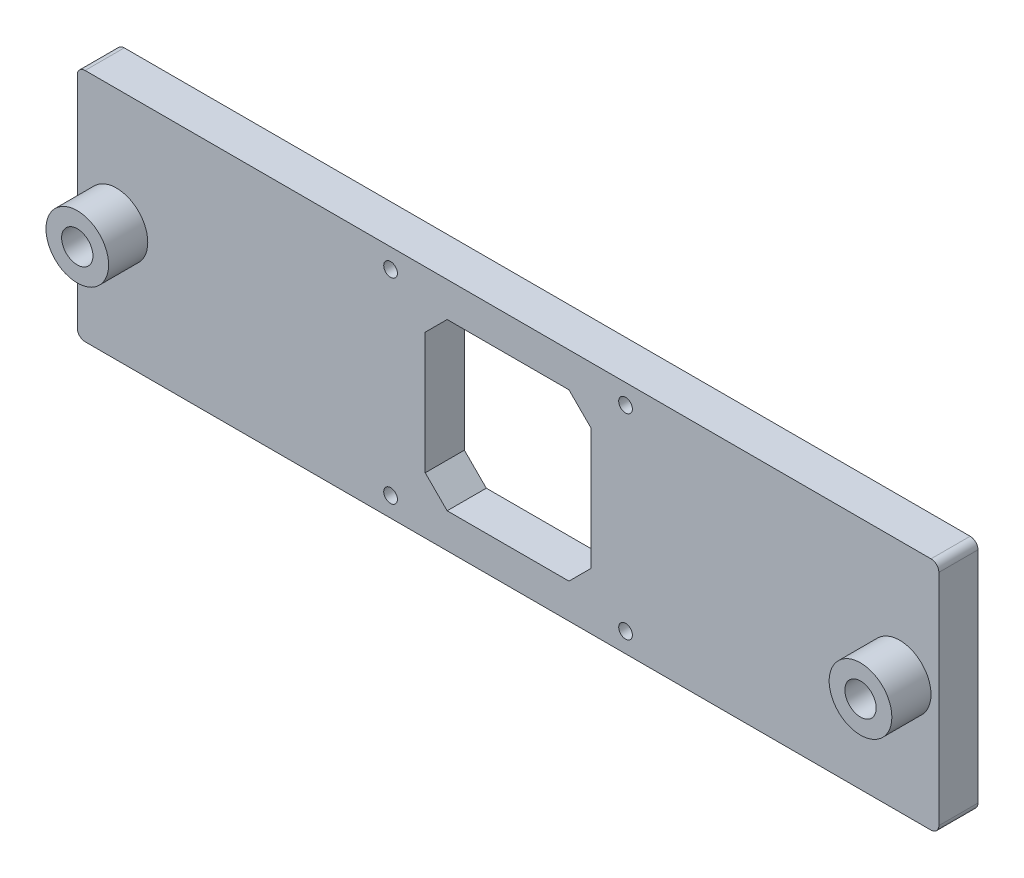
ISO-10303-21;
HEADER;
FILE_DESCRIPTION(('STEP AP214'),'2;1');
FILE_NAME('part.step','',(''),(''),'','','');
FILE_SCHEMA(('AUTOMOTIVE_DESIGN { 1 0 10303 214 1 1 1 1 }'));
ENDSEC;
DATA;
#1=APPLICATION_CONTEXT('core data for automotive mechanical design processes');
#2=APPLICATION_PROTOCOL_DEFINITION('international standard','automotive_design',2000,#1);
#3=PRODUCT_CONTEXT('',#1,'mechanical');
#4=PRODUCT('Part','Part','',(#3));
#5=PRODUCT_RELATED_PRODUCT_CATEGORY('part','',(#4));
#6=PRODUCT_DEFINITION_FORMATION('','',#4);
#7=PRODUCT_DEFINITION_CONTEXT('part definition',#1,'design');
#8=PRODUCT_DEFINITION('design','',#6,#7);
#9=PRODUCT_DEFINITION_SHAPE('','',#8);
#10=(LENGTH_UNIT() NAMED_UNIT(*) SI_UNIT(.MILLI.,.METRE.));
#11=(NAMED_UNIT(*) PLANE_ANGLE_UNIT() SI_UNIT($,.RADIAN.));
#12=(NAMED_UNIT(*) SI_UNIT($,.STERADIAN.) SOLID_ANGLE_UNIT());
#13=UNCERTAINTY_MEASURE_WITH_UNIT(LENGTH_MEASURE(1.E-05),#10,'distance_accuracy_value','');
#14=(GEOMETRIC_REPRESENTATION_CONTEXT(3) GLOBAL_UNCERTAINTY_ASSIGNED_CONTEXT((#13)) GLOBAL_UNIT_ASSIGNED_CONTEXT((#10,
#11,#12)) REPRESENTATION_CONTEXT('',''));
#15=CARTESIAN_POINT('',(0.,0.,0.));
#16=DIRECTION('',(0.,0.,1.));
#17=DIRECTION('',(1.,0.,0.));
#18=AXIS2_PLACEMENT_3D('',#15,#16,#17);
#19=CARTESIAN_POINT('',(0.,0.,5.));
#20=DIRECTION('',(0.,0.,1.));
#21=DIRECTION('',(1.,0.,0.));
#22=AXIS2_PLACEMENT_3D('',#19,#20,#21);
#23=PLANE('',#22);
#24=CARTESIAN_POINT('',(-30.,-25.,5.));
#25=DIRECTION('',(0.,0.,1.));
#26=DIRECTION('',(1.,0.,0.));
#27=AXIS2_PLACEMENT_3D('',#24,#25,#26);
#28=CIRCLE('',#27,1.75);
#29=CARTESIAN_POINT('',(-28.25,-25.,5.));
#30=VERTEX_POINT('',#29);
#31=EDGE_CURVE('E383',#30,#30,#28,.T.);
#32=ORIENTED_EDGE('',*,*,#31,.F.);
#33=EDGE_LOOP('',(#32));
#34=FACE_BOUND('',#33,.T.);
#35=CARTESIAN_POINT('',(30.,25.,5.));
#36=DIRECTION('',(0.,0.,1.));
#37=DIRECTION('',(1.,0.,0.));
#38=AXIS2_PLACEMENT_3D('',#35,#36,#37);
#39=CIRCLE('',#38,1.75);
#40=CARTESIAN_POINT('',(31.75,25.,5.));
#41=VERTEX_POINT('',#40);
#42=EDGE_CURVE('E374',#41,#41,#39,.T.);
#43=ORIENTED_EDGE('',*,*,#42,.F.);
#44=EDGE_LOOP('',(#43));
#45=FACE_BOUND('',#44,.T.);
#46=CARTESIAN_POINT('',(30.,-25.,5.));
#47=DIRECTION('',(0.,0.,1.));
#48=DIRECTION('',(1.,0.,0.));
#49=AXIS2_PLACEMENT_3D('',#46,#47,#48);
#50=CIRCLE('',#49,1.75);
#51=CARTESIAN_POINT('',(31.75,-25.,5.));
#52=VERTEX_POINT('',#51);
#53=EDGE_CURVE('E390',#52,#52,#50,.T.);
#54=ORIENTED_EDGE('',*,*,#53,.F.);
#55=EDGE_LOOP('',(#54));
#56=FACE_BOUND('',#55,.T.);
#57=CARTESIAN_POINT('',(-30.,25.,5.));
#58=DIRECTION('',(0.,0.,1.));
#59=DIRECTION('',(1.,0.,0.));
#60=AXIS2_PLACEMENT_3D('',#57,#58,#59);
#61=CIRCLE('',#60,1.75);
#62=CARTESIAN_POINT('',(-28.25,25.,5.));
#63=VERTEX_POINT('',#62);
#64=EDGE_CURVE('E366',#63,#63,#61,.T.);
#65=ORIENTED_EDGE('',*,*,#64,.F.);
#66=EDGE_LOOP('',(#65));
#67=FACE_BOUND('',#66,.T.);
#68=CARTESIAN_POINT('',(-100.,0.,5.));
#69=DIRECTION('',(0.,0.,1.));
#70=DIRECTION('',(1.,0.,0.));
#71=AXIS2_PLACEMENT_3D('',#68,#69,#70);
#72=CIRCLE('',#71,8.);
#73=CARTESIAN_POINT('',(-92.,0.,5.));
#74=VERTEX_POINT('',#73);
#75=EDGE_CURVE('E342',#74,#74,#72,.T.);
#76=ORIENTED_EDGE('',*,*,#75,.F.);
#77=EDGE_LOOP('',(#76));
#78=FACE_BOUND('',#77,.T.);
#79=DIRECTION('',(-1.,0.,0.));
#80=VECTOR('',#79,1.);
#81=CARTESIAN_POINT('',(-110.,30.,5.));
#82=LINE('',#81,#80);
#83=CARTESIAN_POINT('',(108.,30.,5.));
#84=VERTEX_POINT('',#83);
#85=CARTESIAN_POINT('',(-108.,30.,5.));
#86=VERTEX_POINT('',#85);
#87=EDGE_CURVE('E292',#84,#86,#82,.T.);
#88=ORIENTED_EDGE('',*,*,#87,.T.);
#89=CARTESIAN_POINT('',(-108.,28.,5.));
#90=DIRECTION('',(0.,0.,1.));
#91=DIRECTION('',(1.,0.,0.));
#92=AXIS2_PLACEMENT_3D('',#89,#90,#91);
#93=CIRCLE('',#92,2.);
#94=CARTESIAN_POINT('',(-110.,28.,5.));
#95=VERTEX_POINT('',#94);
#96=EDGE_CURVE('E267',#86,#95,#93,.T.);
#97=ORIENTED_EDGE('',*,*,#96,.T.);
#98=DIRECTION('',(0.,-1.,0.));
#99=VECTOR('',#98,1.);
#100=CARTESIAN_POINT('',(-110.,30.,5.));
#101=LINE('',#100,#99);
#102=CARTESIAN_POINT('',(-110.,-28.,5.));
#103=VERTEX_POINT('',#102);
#104=EDGE_CURVE('E189',#95,#103,#101,.T.);
#105=ORIENTED_EDGE('',*,*,#104,.T.);
#106=CARTESIAN_POINT('',(-108.,-28.,5.));
#107=DIRECTION('',(0.,0.,1.));
#108=DIRECTION('',(1.,0.,0.));
#109=AXIS2_PLACEMENT_3D('',#106,#107,#108);
#110=CIRCLE('',#109,2.);
#111=CARTESIAN_POINT('',(-108.,-30.,5.));
#112=VERTEX_POINT('',#111);
#113=EDGE_CURVE('E60',#103,#112,#110,.T.);
#114=ORIENTED_EDGE('',*,*,#113,.T.);
#115=DIRECTION('',(1.,0.,0.));
#116=VECTOR('',#115,1.);
#117=CARTESIAN_POINT('',(-110.,-30.,5.));
#118=LINE('',#117,#116);
#119=CARTESIAN_POINT('',(108.,-30.,5.));
#120=VERTEX_POINT('',#119);
#121=EDGE_CURVE('E183',#112,#120,#118,.T.);
#122=ORIENTED_EDGE('',*,*,#121,.T.);
#123=CARTESIAN_POINT('',(108.,-28.,5.));
#124=DIRECTION('',(0.,0.,1.));
#125=DIRECTION('',(1.,0.,0.));
#126=AXIS2_PLACEMENT_3D('',#123,#124,#125);
#127=CIRCLE('',#126,2.);
#128=CARTESIAN_POINT('',(110.,-28.,5.));
#129=VERTEX_POINT('',#128);
#130=EDGE_CURVE('E261',#120,#129,#127,.T.);
#131=ORIENTED_EDGE('',*,*,#130,.T.);
#132=DIRECTION('',(0.,1.,0.));
#133=VECTOR('',#132,1.);
#134=CARTESIAN_POINT('',(110.,30.,5.));
#135=LINE('',#134,#133);
#136=CARTESIAN_POINT('',(110.,28.,5.));
#137=VERTEX_POINT('',#136);
#138=EDGE_CURVE('E287',#129,#137,#135,.T.);
#139=ORIENTED_EDGE('',*,*,#138,.T.);
#140=CARTESIAN_POINT('',(108.,28.,5.));
#141=DIRECTION('',(0.,0.,1.));
#142=DIRECTION('',(1.,0.,0.));
#143=AXIS2_PLACEMENT_3D('',#140,#141,#142);
#144=CIRCLE('',#143,2.);
#145=EDGE_CURVE('E264',#137,#84,#144,.T.);
#146=ORIENTED_EDGE('',*,*,#145,.T.);
#147=EDGE_LOOP('',(#88,#97,#105,#114,#122,#131,#139,#146));
#148=FACE_BOUND('',#147,.T.);
#149=DIRECTION('',(-1.,0.,0.));
#150=VECTOR('',#149,1.);
#151=CARTESIAN_POINT('',(-21.15,21.15,5.));
#152=LINE('',#151,#150);
#153=CARTESIAN_POINT('',(15.5498,21.15,5.));
#154=VERTEX_POINT('',#153);
#155=CARTESIAN_POINT('',(-15.5498,21.15,5.));
#156=VERTEX_POINT('',#155);
#157=EDGE_CURVE('E328',#154,#156,#152,.T.);
#158=ORIENTED_EDGE('',*,*,#157,.F.);
#159=DIRECTION('',(-0.707106781186548,0.707106781186547,0.));
#160=VECTOR('',#159,1.);
#161=CARTESIAN_POINT('',(21.15,15.5498,5.));
#162=LINE('',#161,#160);
#163=CARTESIAN_POINT('',(21.15,15.5498,5.));
#164=VERTEX_POINT('',#163);
#165=EDGE_CURVE('E166',#154,#164,#162,.F.);
#166=ORIENTED_EDGE('',*,*,#165,.T.);
#167=DIRECTION('',(0.,1.,0.));
#168=VECTOR('',#167,1.);
#169=CARTESIAN_POINT('',(21.15,21.15,5.));
#170=LINE('',#169,#168);
#171=CARTESIAN_POINT('',(21.15,-15.5498,5.));
#172=VERTEX_POINT('',#171);
#173=EDGE_CURVE('E314',#172,#164,#170,.T.);
#174=ORIENTED_EDGE('',*,*,#173,.F.);
#175=DIRECTION('',(0.707106781186548,0.707106781186548,0.));
#176=VECTOR('',#175,1.);
#177=CARTESIAN_POINT('',(15.5498,-21.15,5.));
#178=LINE('',#177,#176);
#179=CARTESIAN_POINT('',(15.5498,-21.15,5.));
#180=VERTEX_POINT('',#179);
#181=EDGE_CURVE('E224',#172,#180,#178,.F.);
#182=ORIENTED_EDGE('',*,*,#181,.T.);
#183=DIRECTION('',(1.,0.,0.));
#184=VECTOR('',#183,1.);
#185=CARTESIAN_POINT('',(-21.15,-21.15,5.));
#186=LINE('',#185,#184);
#187=CARTESIAN_POINT('',(-15.5498,-21.15,5.));
#188=VERTEX_POINT('',#187);
#189=EDGE_CURVE('E304',#188,#180,#186,.T.);
#190=ORIENTED_EDGE('',*,*,#189,.F.);
#191=DIRECTION('',(0.707106781186547,-0.707106781186548,0.));
#192=VECTOR('',#191,1.);
#193=CARTESIAN_POINT('',(-21.15,-15.5498,5.));
#194=LINE('',#193,#192);
#195=CARTESIAN_POINT('',(-21.15,-15.5498,5.));
#196=VERTEX_POINT('',#195);
#197=EDGE_CURVE('E230',#188,#196,#194,.F.);
#198=ORIENTED_EDGE('',*,*,#197,.T.);
#199=DIRECTION('',(0.,-1.,0.));
#200=VECTOR('',#199,1.);
#201=CARTESIAN_POINT('',(-21.15,21.15,5.));
#202=LINE('',#201,#200);
#203=CARTESIAN_POINT('',(-21.15,15.5498,5.));
#204=VERTEX_POINT('',#203);
#205=EDGE_CURVE('E324',#204,#196,#202,.T.);
#206=ORIENTED_EDGE('',*,*,#205,.F.);
#207=DIRECTION('',(-0.707106781186548,-0.707106781186547,0.));
#208=VECTOR('',#207,1.);
#209=CARTESIAN_POINT('',(-15.5498,21.15,5.));
#210=LINE('',#209,#208);
#211=EDGE_CURVE('E167',#204,#156,#210,.F.);
#212=ORIENTED_EDGE('',*,*,#211,.T.);
#213=EDGE_LOOP('',(#158,#166,#174,#182,#190,#198,#206,#212));
#214=FACE_BOUND('',#213,.T.);
#215=CARTESIAN_POINT('',(100.,0.,5.));
#216=DIRECTION('',(0.,0.,1.));
#217=DIRECTION('',(1.,0.,0.));
#218=AXIS2_PLACEMENT_3D('',#215,#216,#217);
#219=CIRCLE('',#218,8.00000000000001);
#220=CARTESIAN_POINT('',(108.,0.,5.));
#221=VERTEX_POINT('',#220);
#222=EDGE_CURVE('E354',#221,#221,#219,.T.);
#223=ORIENTED_EDGE('',*,*,#222,.F.);
#224=EDGE_LOOP('',(#223));
#225=FACE_BOUND('',#224,.T.);
#226=ADVANCED_FACE('F39',(#34,#45,#56,#67,#78,#148,#214,#225),#23,.T.);
#227=CARTESIAN_POINT('',(0.,0.,-5.));
#228=DIRECTION('',(0.,0.,1.));
#229=DIRECTION('',(1.,0.,0.));
#230=AXIS2_PLACEMENT_3D('',#227,#228,#229);
#231=PLANE('',#230);
#232=CARTESIAN_POINT('',(-30.,-25.,-5.));
#233=DIRECTION('',(0.,0.,1.));
#234=DIRECTION('',(1.,0.,0.));
#235=AXIS2_PLACEMENT_3D('',#232,#233,#234);
#236=CIRCLE('',#235,1.75);
#237=CARTESIAN_POINT('',(-28.25,-25.,-5.));
#238=VERTEX_POINT('',#237);
#239=EDGE_CURVE('E370',#238,#238,#236,.T.);
#240=ORIENTED_EDGE('',*,*,#239,.T.);
#241=EDGE_LOOP('',(#240));
#242=FACE_BOUND('',#241,.T.);
#243=CARTESIAN_POINT('',(30.,25.,-5.));
#244=DIRECTION('',(0.,0.,1.));
#245=DIRECTION('',(1.,0.,0.));
#246=AXIS2_PLACEMENT_3D('',#243,#244,#245);
#247=CIRCLE('',#246,1.75);
#248=CARTESIAN_POINT('',(31.75,25.,-5.));
#249=VERTEX_POINT('',#248);
#250=EDGE_CURVE('E378',#249,#249,#247,.T.);
#251=ORIENTED_EDGE('',*,*,#250,.T.);
#252=EDGE_LOOP('',(#251));
#253=FACE_BOUND('',#252,.T.);
#254=CARTESIAN_POINT('',(30.,-25.,-5.));
#255=DIRECTION('',(0.,0.,1.));
#256=DIRECTION('',(1.,0.,0.));
#257=AXIS2_PLACEMENT_3D('',#254,#255,#256);
#258=CIRCLE('',#257,1.75);
#259=CARTESIAN_POINT('',(31.75,-25.,-5.));
#260=VERTEX_POINT('',#259);
#261=EDGE_CURVE('E379',#260,#260,#258,.T.);
#262=ORIENTED_EDGE('',*,*,#261,.T.);
#263=EDGE_LOOP('',(#262));
#264=FACE_BOUND('',#263,.T.);
#265=CARTESIAN_POINT('',(-30.,25.,-5.));
#266=DIRECTION('',(0.,0.,1.));
#267=DIRECTION('',(1.,0.,0.));
#268=AXIS2_PLACEMENT_3D('',#265,#266,#267);
#269=CIRCLE('',#268,1.75);
#270=CARTESIAN_POINT('',(-28.25,25.,-5.));
#271=VERTEX_POINT('',#270);
#272=EDGE_CURVE('E365',#271,#271,#269,.T.);
#273=ORIENTED_EDGE('',*,*,#272,.T.);
#274=EDGE_LOOP('',(#273));
#275=FACE_BOUND('',#274,.T.);
#276=DIRECTION('',(0.,-1.,0.));
#277=VECTOR('',#276,1.);
#278=CARTESIAN_POINT('',(-110.,30.,-5.));
#279=LINE('',#278,#277);
#280=CARTESIAN_POINT('',(-110.,28.,-5.));
#281=VERTEX_POINT('',#280);
#282=CARTESIAN_POINT('',(-110.,-28.,-5.));
#283=VERTEX_POINT('',#282);
#284=EDGE_CURVE('E288',#281,#283,#279,.T.);
#285=ORIENTED_EDGE('',*,*,#284,.F.);
#286=CARTESIAN_POINT('',(-108.,28.,-5.));
#287=DIRECTION('',(0.,0.,1.));
#288=DIRECTION('',(1.,0.,0.));
#289=AXIS2_PLACEMENT_3D('',#286,#287,#288);
#290=CIRCLE('',#289,2.);
#291=CARTESIAN_POINT('',(-108.,30.,-5.));
#292=VERTEX_POINT('',#291);
#293=EDGE_CURVE('E249',#281,#292,#290,.F.);
#294=ORIENTED_EDGE('',*,*,#293,.T.);
#295=DIRECTION('',(-1.,0.,0.));
#296=VECTOR('',#295,1.);
#297=CARTESIAN_POINT('',(-110.,30.,-5.));
#298=LINE('',#297,#296);
#299=CARTESIAN_POINT('',(108.,30.,-5.));
#300=VERTEX_POINT('',#299);
#301=EDGE_CURVE('E294',#300,#292,#298,.T.);
#302=ORIENTED_EDGE('',*,*,#301,.F.);
#303=CARTESIAN_POINT('',(108.,28.,-5.));
#304=DIRECTION('',(0.,0.,1.));
#305=DIRECTION('',(1.,0.,0.));
#306=AXIS2_PLACEMENT_3D('',#303,#304,#305);
#307=CIRCLE('',#306,2.);
#308=CARTESIAN_POINT('',(110.,28.,-5.));
#309=VERTEX_POINT('',#308);
#310=EDGE_CURVE('E246',#300,#309,#307,.F.);
#311=ORIENTED_EDGE('',*,*,#310,.T.);
#312=DIRECTION('',(0.,1.,0.));
#313=VECTOR('',#312,1.);
#314=CARTESIAN_POINT('',(110.,30.,-5.));
#315=LINE('',#314,#313);
#316=CARTESIAN_POINT('',(110.,-28.,-5.));
#317=VERTEX_POINT('',#316);
#318=EDGE_CURVE('E299',#317,#309,#315,.T.);
#319=ORIENTED_EDGE('',*,*,#318,.F.);
#320=CARTESIAN_POINT('',(108.,-28.,-5.));
#321=DIRECTION('',(0.,0.,1.));
#322=DIRECTION('',(1.,0.,0.));
#323=AXIS2_PLACEMENT_3D('',#320,#321,#322);
#324=CIRCLE('',#323,2.);
#325=CARTESIAN_POINT('',(108.,-30.,-5.));
#326=VERTEX_POINT('',#325);
#327=EDGE_CURVE('E243',#317,#326,#324,.F.);
#328=ORIENTED_EDGE('',*,*,#327,.T.);
#329=DIRECTION('',(1.,0.,0.));
#330=VECTOR('',#329,1.);
#331=CARTESIAN_POINT('',(-110.,-30.,-5.));
#332=LINE('',#331,#330);
#333=CARTESIAN_POINT('',(-108.,-30.,-5.));
#334=VERTEX_POINT('',#333);
#335=EDGE_CURVE('E192',#334,#326,#332,.T.);
#336=ORIENTED_EDGE('',*,*,#335,.F.);
#337=CARTESIAN_POINT('',(-108.,-28.,-5.));
#338=DIRECTION('',(0.,0.,1.));
#339=DIRECTION('',(1.,0.,0.));
#340=AXIS2_PLACEMENT_3D('',#337,#338,#339);
#341=CIRCLE('',#340,2.);
#342=EDGE_CURVE('E240',#334,#283,#341,.F.);
#343=ORIENTED_EDGE('',*,*,#342,.T.);
#344=EDGE_LOOP('',(#285,#294,#302,#311,#319,#328,#336,#343));
#345=FACE_BOUND('',#344,.T.);
#346=DIRECTION('',(1.,0.,0.));
#347=VECTOR('',#346,1.);
#348=CARTESIAN_POINT('',(-21.15,-21.15,-5.));
#349=LINE('',#348,#347);
#350=CARTESIAN_POINT('',(-15.5498,-21.15,-5.));
#351=VERTEX_POINT('',#350);
#352=CARTESIAN_POINT('',(15.5498,-21.15,-5.));
#353=VERTEX_POINT('',#352);
#354=EDGE_CURVE('E311',#351,#353,#349,.T.);
#355=ORIENTED_EDGE('',*,*,#354,.T.);
#356=DIRECTION('',(-0.707106781186548,-0.707106781186548,0.));
#357=VECTOR('',#356,1.);
#358=CARTESIAN_POINT('',(18.3499,-18.3499,-5.));
#359=LINE('',#358,#357);
#360=CARTESIAN_POINT('',(21.15,-15.5498,-5.));
#361=VERTEX_POINT('',#360);
#362=EDGE_CURVE('E221',#353,#361,#359,.F.);
#363=ORIENTED_EDGE('',*,*,#362,.T.);
#364=DIRECTION('',(0.,1.,0.));
#365=VECTOR('',#364,1.);
#366=CARTESIAN_POINT('',(21.15,21.15,-5.));
#367=LINE('',#366,#365);
#368=CARTESIAN_POINT('',(21.15,15.5498,-5.));
#369=VERTEX_POINT('',#368);
#370=EDGE_CURVE('E160',#361,#369,#367,.T.);
#371=ORIENTED_EDGE('',*,*,#370,.T.);
#372=DIRECTION('',(0.707106781186548,-0.707106781186547,0.));
#373=VECTOR('',#372,1.);
#374=CARTESIAN_POINT('',(18.3499,18.3499,-5.));
#375=LINE('',#374,#373);
#376=CARTESIAN_POINT('',(15.5498,21.15,-5.));
#377=VERTEX_POINT('',#376);
#378=EDGE_CURVE('E153',#369,#377,#375,.F.);
#379=ORIENTED_EDGE('',*,*,#378,.T.);
#380=DIRECTION('',(-1.,0.,0.));
#381=VECTOR('',#380,1.);
#382=CARTESIAN_POINT('',(-21.15,21.15,-5.));
#383=LINE('',#382,#381);
#384=CARTESIAN_POINT('',(-15.5498,21.15,-5.));
#385=VERTEX_POINT('',#384);
#386=EDGE_CURVE('E158',#377,#385,#383,.T.);
#387=ORIENTED_EDGE('',*,*,#386,.T.);
#388=DIRECTION('',(0.707106781186548,0.707106781186547,0.));
#389=VECTOR('',#388,1.);
#390=CARTESIAN_POINT('',(-18.3499,18.3499,-5.));
#391=LINE('',#390,#389);
#392=CARTESIAN_POINT('',(-21.15,15.5498,-5.));
#393=VERTEX_POINT('',#392);
#394=EDGE_CURVE('E214',#385,#393,#391,.F.);
#395=ORIENTED_EDGE('',*,*,#394,.T.);
#396=DIRECTION('',(0.,-1.,0.));
#397=VECTOR('',#396,1.);
#398=CARTESIAN_POINT('',(-21.15,21.15,-5.));
#399=LINE('',#398,#397);
#400=CARTESIAN_POINT('',(-21.15,-15.5498,-5.));
#401=VERTEX_POINT('',#400);
#402=EDGE_CURVE('E178',#393,#401,#399,.T.);
#403=ORIENTED_EDGE('',*,*,#402,.T.);
#404=DIRECTION('',(-0.707106781186547,0.707106781186548,0.));
#405=VECTOR('',#404,1.);
#406=CARTESIAN_POINT('',(-18.3499,-18.3499,-5.));
#407=LINE('',#406,#405);
#408=EDGE_CURVE('E227',#401,#351,#407,.F.);
#409=ORIENTED_EDGE('',*,*,#408,.T.);
#410=EDGE_LOOP('',(#355,#363,#371,#379,#387,#395,#403,#409));
#411=FACE_BOUND('',#410,.T.);
#412=CARTESIAN_POINT('',(100.,0.,-5.));
#413=DIRECTION('',(0.,0.,1.));
#414=DIRECTION('',(1.,0.,0.));
#415=AXIS2_PLACEMENT_3D('',#412,#413,#414);
#416=CIRCLE('',#415,3.99999999999999);
#417=CARTESIAN_POINT('',(104.,0.,-5.));
#418=VERTEX_POINT('',#417);
#419=EDGE_CURVE('E320',#418,#418,#416,.T.);
#420=ORIENTED_EDGE('',*,*,#419,.T.);
#421=EDGE_LOOP('',(#420));
#422=FACE_BOUND('',#421,.T.);
#423=CARTESIAN_POINT('',(-100.,0.,-5.));
#424=DIRECTION('',(0.,0.,1.));
#425=DIRECTION('',(1.,0.,0.));
#426=AXIS2_PLACEMENT_3D('',#423,#424,#425);
#427=CIRCLE('',#426,4.00000000000001);
#428=CARTESIAN_POINT('',(-96.,0.,-5.));
#429=VERTEX_POINT('',#428);
#430=EDGE_CURVE('E337',#429,#429,#427,.T.);
#431=ORIENTED_EDGE('',*,*,#430,.T.);
#432=EDGE_LOOP('',(#431));
#433=FACE_BOUND('',#432,.T.);
#434=ADVANCED_FACE('F156',(#242,#253,#264,#275,#345,#411,#422,#433),#231,.F.);
#435=CARTESIAN_POINT('',(110.,30.,5.));
#436=DIRECTION('',(-1.,0.,0.));
#437=DIRECTION('',(0.,0.,1.));
#438=AXIS2_PLACEMENT_3D('',#435,#436,#437);
#439=PLANE('',#438);
#440=ORIENTED_EDGE('',*,*,#318,.T.);
#441=DIRECTION('',(0.,0.,-1.));
#442=VECTOR('',#441,1.);
#443=CARTESIAN_POINT('',(110.,28.,5.));
#444=LINE('',#443,#442);
#445=EDGE_CURVE('E274',#309,#137,#444,.F.);
#446=ORIENTED_EDGE('',*,*,#445,.T.);
#447=ORIENTED_EDGE('',*,*,#138,.F.);
#448=DIRECTION('',(0.,0.,-1.));
#449=VECTOR('',#448,1.);
#450=CARTESIAN_POINT('',(110.,-28.,5.));
#451=LINE('',#450,#449);
#452=EDGE_CURVE('E270',#129,#317,#451,.T.);
#453=ORIENTED_EDGE('',*,*,#452,.T.);
#454=EDGE_LOOP('',(#440,#446,#447,#453));
#455=FACE_BOUND('',#454,.T.);
#456=ADVANCED_FACE('F470',(#455),#439,.F.);
#457=CARTESIAN_POINT('',(-110.,30.,5.));
#458=DIRECTION('',(0.,-1.,0.));
#459=DIRECTION('',(0.,0.,-1.));
#460=AXIS2_PLACEMENT_3D('',#457,#458,#459);
#461=PLANE('',#460);
#462=ORIENTED_EDGE('',*,*,#301,.T.);
#463=DIRECTION('',(0.,0.,-1.));
#464=VECTOR('',#463,1.);
#465=CARTESIAN_POINT('',(-108.,30.,5.));
#466=LINE('',#465,#464);
#467=EDGE_CURVE('E256',#292,#86,#466,.F.);
#468=ORIENTED_EDGE('',*,*,#467,.T.);
#469=ORIENTED_EDGE('',*,*,#87,.F.);
#470=DIRECTION('',(0.,0.,-1.));
#471=VECTOR('',#470,1.);
#472=CARTESIAN_POINT('',(108.,30.,5.));
#473=LINE('',#472,#471);
#474=EDGE_CURVE('E252',#84,#300,#473,.T.);
#475=ORIENTED_EDGE('',*,*,#474,.T.);
#476=EDGE_LOOP('',(#462,#468,#469,#475));
#477=FACE_BOUND('',#476,.T.);
#478=ADVANCED_FACE('F477',(#477),#461,.F.);
#479=CARTESIAN_POINT('',(-110.,30.,5.));
#480=DIRECTION('',(1.,0.,0.));
#481=DIRECTION('',(0.,1.,0.));
#482=AXIS2_PLACEMENT_3D('',#479,#480,#481);
#483=PLANE('',#482);
#484=ORIENTED_EDGE('',*,*,#104,.F.);
#485=DIRECTION('',(0.,0.,-1.));
#486=VECTOR('',#485,1.);
#487=CARTESIAN_POINT('',(-110.,28.,5.));
#488=LINE('',#487,#486);
#489=EDGE_CURVE('E236',#95,#281,#488,.T.);
#490=ORIENTED_EDGE('',*,*,#489,.T.);
#491=ORIENTED_EDGE('',*,*,#284,.T.);
#492=DIRECTION('',(0.,0.,-1.));
#493=VECTOR('',#492,1.);
#494=CARTESIAN_POINT('',(-110.,-28.,5.));
#495=LINE('',#494,#493);
#496=EDGE_CURVE('E233',#283,#103,#495,.F.);
#497=ORIENTED_EDGE('',*,*,#496,.T.);
#498=EDGE_LOOP('',(#484,#490,#491,#497));
#499=FACE_BOUND('',#498,.T.);
#500=ADVANCED_FACE('F474',(#499),#483,.F.);
#501=CARTESIAN_POINT('',(-110.,-30.,5.));
#502=DIRECTION('',(0.,1.,0.));
#503=DIRECTION('',(0.,0.,1.));
#504=AXIS2_PLACEMENT_3D('',#501,#502,#503);
#505=PLANE('',#504);
#506=ORIENTED_EDGE('',*,*,#335,.T.);
#507=DIRECTION('',(0.,0.,-1.));
#508=VECTOR('',#507,1.);
#509=CARTESIAN_POINT('',(108.,-30.,5.));
#510=LINE('',#509,#508);
#511=EDGE_CURVE('E11',#326,#120,#510,.F.);
#512=ORIENTED_EDGE('',*,*,#511,.T.);
#513=ORIENTED_EDGE('',*,*,#121,.F.);
#514=DIRECTION('',(0.,0.,-1.));
#515=VECTOR('',#514,1.);
#516=CARTESIAN_POINT('',(-108.,-30.,5.));
#517=LINE('',#516,#515);
#518=EDGE_CURVE('E48',#112,#334,#517,.T.);
#519=ORIENTED_EDGE('',*,*,#518,.T.);
#520=EDGE_LOOP('',(#506,#512,#513,#519));
#521=FACE_BOUND('',#520,.T.);
#522=ADVANCED_FACE('F280',(#521),#505,.F.);
#523=CARTESIAN_POINT('',(21.15,21.15,5.));
#524=DIRECTION('',(-1.,0.,0.));
#525=DIRECTION('',(0.,-1.,0.));
#526=AXIS2_PLACEMENT_3D('',#523,#524,#525);
#527=PLANE('',#526);
#528=ORIENTED_EDGE('',*,*,#173,.T.);
#529=DIRECTION('',(0.,0.,-1.));
#530=VECTOR('',#529,1.);
#531=CARTESIAN_POINT('',(21.15,15.5498,-5.));
#532=LINE('',#531,#530);
#533=EDGE_CURVE('E204',#164,#369,#532,.T.);
#534=ORIENTED_EDGE('',*,*,#533,.T.);
#535=ORIENTED_EDGE('',*,*,#370,.F.);
#536=DIRECTION('',(0.,0.,1.));
#537=VECTOR('',#536,1.);
#538=CARTESIAN_POINT('',(21.15,-15.5498,5.));
#539=LINE('',#538,#537);
#540=EDGE_CURVE('E201',#361,#172,#539,.T.);
#541=ORIENTED_EDGE('',*,*,#540,.T.);
#542=EDGE_LOOP('',(#528,#534,#535,#541));
#543=FACE_BOUND('',#542,.T.);
#544=ADVANCED_FACE('F464',(#543),#527,.T.);
#545=CARTESIAN_POINT('',(-21.15,21.15,5.));
#546=DIRECTION('',(0.,-1.,0.));
#547=DIRECTION('',(0.,0.,-1.));
#548=AXIS2_PLACEMENT_3D('',#545,#546,#547);
#549=PLANE('',#548);
#550=ORIENTED_EDGE('',*,*,#157,.T.);
#551=DIRECTION('',(0.,0.,-1.));
#552=VECTOR('',#551,1.);
#553=CARTESIAN_POINT('',(-15.5498,21.15,-5.));
#554=LINE('',#553,#552);
#555=EDGE_CURVE('E176',#156,#385,#554,.T.);
#556=ORIENTED_EDGE('',*,*,#555,.T.);
#557=ORIENTED_EDGE('',*,*,#386,.F.);
#558=DIRECTION('',(0.,0.,1.));
#559=VECTOR('',#558,1.);
#560=CARTESIAN_POINT('',(15.5498,21.15,5.));
#561=LINE('',#560,#559);
#562=EDGE_CURVE('E173',#377,#154,#561,.T.);
#563=ORIENTED_EDGE('',*,*,#562,.T.);
#564=EDGE_LOOP('',(#550,#556,#557,#563));
#565=FACE_BOUND('',#564,.T.);
#566=ADVANCED_FACE('F172',(#565),#549,.T.);
#567=CARTESIAN_POINT('',(-21.15,21.15,5.));
#568=DIRECTION('',(1.,0.,0.));
#569=DIRECTION('',(0.,1.,0.));
#570=AXIS2_PLACEMENT_3D('',#567,#568,#569);
#571=PLANE('',#570);
#572=ORIENTED_EDGE('',*,*,#402,.F.);
#573=DIRECTION('',(0.,0.,1.));
#574=VECTOR('',#573,1.);
#575=CARTESIAN_POINT('',(-21.15,15.5498,5.));
#576=LINE('',#575,#574);
#577=EDGE_CURVE('E198',#393,#204,#576,.T.);
#578=ORIENTED_EDGE('',*,*,#577,.T.);
#579=ORIENTED_EDGE('',*,*,#205,.T.);
#580=DIRECTION('',(0.,0.,-1.));
#581=VECTOR('',#580,1.);
#582=CARTESIAN_POINT('',(-21.15,-15.5498,-5.));
#583=LINE('',#582,#581);
#584=EDGE_CURVE('E187',#196,#401,#583,.T.);
#585=ORIENTED_EDGE('',*,*,#584,.T.);
#586=EDGE_LOOP('',(#572,#578,#579,#585));
#587=FACE_BOUND('',#586,.T.);
#588=ADVANCED_FACE('F457',(#587),#571,.T.);
#589=CARTESIAN_POINT('',(-21.15,-21.15,5.));
#590=DIRECTION('',(0.,1.,0.));
#591=DIRECTION('',(0.,0.,1.));
#592=AXIS2_PLACEMENT_3D('',#589,#590,#591);
#593=PLANE('',#592);
#594=ORIENTED_EDGE('',*,*,#189,.T.);
#595=DIRECTION('',(0.,0.,-1.));
#596=VECTOR('',#595,1.);
#597=CARTESIAN_POINT('',(15.5498,-21.15,-5.));
#598=LINE('',#597,#596);
#599=EDGE_CURVE('E210',#180,#353,#598,.T.);
#600=ORIENTED_EDGE('',*,*,#599,.T.);
#601=ORIENTED_EDGE('',*,*,#354,.F.);
#602=DIRECTION('',(0.,0.,1.));
#603=VECTOR('',#602,1.);
#604=CARTESIAN_POINT('',(-15.5498,-21.15,5.));
#605=LINE('',#604,#603);
#606=EDGE_CURVE('E207',#351,#188,#605,.T.);
#607=ORIENTED_EDGE('',*,*,#606,.T.);
#608=EDGE_LOOP('',(#594,#600,#601,#607));
#609=FACE_BOUND('',#608,.T.);
#610=ADVANCED_FACE('F453',(#609),#593,.T.);
#611=CARTESIAN_POINT('',(100.,0.,5.));
#612=DIRECTION('',(0.,0.,-1.));
#613=DIRECTION('',(-1.,0.,0.));
#614=AXIS2_PLACEMENT_3D('',#611,#612,#613);
#615=CYLINDRICAL_SURFACE('',#614,3.99999999999999);
#616=ORIENTED_EDGE('',*,*,#419,.F.);
#617=EDGE_LOOP('',(#616));
#618=FACE_BOUND('',#617,.T.);
#619=CARTESIAN_POINT('',(100.,0.,15.));
#620=DIRECTION('',(0.,0.,1.));
#621=DIRECTION('',(1.,0.,0.));
#622=AXIS2_PLACEMENT_3D('',#619,#620,#621);
#623=CIRCLE('',#622,3.99999999999999);
#624=CARTESIAN_POINT('',(104.,0.,15.));
#625=VERTEX_POINT('',#624);
#626=EDGE_CURVE('E358',#625,#625,#623,.T.);
#627=ORIENTED_EDGE('',*,*,#626,.T.);
#628=EDGE_LOOP('',(#627));
#629=FACE_BOUND('',#628,.T.);
#630=ADVANCED_FACE('F449',(#618,#629),#615,.F.);
#631=CARTESIAN_POINT('',(-100.,0.,5.));
#632=DIRECTION('',(0.,0.,-1.));
#633=DIRECTION('',(-1.,0.,0.));
#634=AXIS2_PLACEMENT_3D('',#631,#632,#633);
#635=CYLINDRICAL_SURFACE('',#634,4.00000000000001);
#636=ORIENTED_EDGE('',*,*,#430,.F.);
#637=EDGE_LOOP('',(#636));
#638=FACE_BOUND('',#637,.T.);
#639=CARTESIAN_POINT('',(-100.,0.,15.));
#640=DIRECTION('',(0.,0.,1.));
#641=DIRECTION('',(1.,0.,0.));
#642=AXIS2_PLACEMENT_3D('',#639,#640,#641);
#643=CIRCLE('',#642,4.00000000000001);
#644=CARTESIAN_POINT('',(-96.,0.,15.));
#645=VERTEX_POINT('',#644);
#646=EDGE_CURVE('E346',#645,#645,#643,.T.);
#647=ORIENTED_EDGE('',*,*,#646,.T.);
#648=EDGE_LOOP('',(#647));
#649=FACE_BOUND('',#648,.T.);
#650=ADVANCED_FACE('F445',(#638,#649),#635,.F.);
#651=CARTESIAN_POINT('',(-15.5498,21.15,5.));
#652=DIRECTION('',(0.707106781186547,-0.707106781186548,0.));
#653=DIRECTION('',(0.,0.,1.));
#654=AXIS2_PLACEMENT_3D('',#651,#652,#653);
#655=PLANE('',#654);
#656=ORIENTED_EDGE('',*,*,#211,.F.);
#657=ORIENTED_EDGE('',*,*,#577,.F.);
#658=ORIENTED_EDGE('',*,*,#394,.F.);
#659=ORIENTED_EDGE('',*,*,#555,.F.);
#660=EDGE_LOOP('',(#656,#657,#658,#659));
#661=FACE_BOUND('',#660,.T.);
#662=ADVANCED_FACE('F448',(#661),#655,.T.);
#663=CARTESIAN_POINT('',(21.15,15.5498,5.));
#664=DIRECTION('',(-0.707106781186547,-0.707106781186547,0.));
#665=DIRECTION('',(0.,0.,1.));
#666=AXIS2_PLACEMENT_3D('',#663,#664,#665);
#667=PLANE('',#666);
#668=ORIENTED_EDGE('',*,*,#165,.F.);
#669=ORIENTED_EDGE('',*,*,#562,.F.);
#670=ORIENTED_EDGE('',*,*,#378,.F.);
#671=ORIENTED_EDGE('',*,*,#533,.F.);
#672=EDGE_LOOP('',(#668,#669,#670,#671));
#673=FACE_BOUND('',#672,.T.);
#674=ADVANCED_FACE('F181',(#673),#667,.T.);
#675=CARTESIAN_POINT('',(15.5498,-21.15,5.));
#676=DIRECTION('',(-0.707106781186547,0.707106781186547,0.));
#677=DIRECTION('',(0.,0.,1.));
#678=AXIS2_PLACEMENT_3D('',#675,#676,#677);
#679=PLANE('',#678);
#680=ORIENTED_EDGE('',*,*,#181,.F.);
#681=ORIENTED_EDGE('',*,*,#540,.F.);
#682=ORIENTED_EDGE('',*,*,#362,.F.);
#683=ORIENTED_EDGE('',*,*,#599,.F.);
#684=EDGE_LOOP('',(#680,#681,#682,#683));
#685=FACE_BOUND('',#684,.T.);
#686=ADVANCED_FACE('F489',(#685),#679,.T.);
#687=CARTESIAN_POINT('',(-21.15,-15.5498,5.));
#688=DIRECTION('',(0.707106781186548,0.707106781186547,0.));
#689=DIRECTION('',(0.,0.,1.));
#690=AXIS2_PLACEMENT_3D('',#687,#688,#689);
#691=PLANE('',#690);
#692=ORIENTED_EDGE('',*,*,#197,.F.);
#693=ORIENTED_EDGE('',*,*,#606,.F.);
#694=ORIENTED_EDGE('',*,*,#408,.F.);
#695=ORIENTED_EDGE('',*,*,#584,.F.);
#696=EDGE_LOOP('',(#692,#693,#694,#695));
#697=FACE_BOUND('',#696,.T.);
#698=ADVANCED_FACE('F440',(#697),#691,.T.);
#699=CARTESIAN_POINT('',(-100.,0.,15.));
#700=DIRECTION('',(0.,0.,1.));
#701=DIRECTION('',(1.,0.,0.));
#702=AXIS2_PLACEMENT_3D('',#699,#700,#701);
#703=PLANE('',#702);
#704=CARTESIAN_POINT('',(-100.,0.,15.));
#705=DIRECTION('',(0.,0.,1.));
#706=DIRECTION('',(1.,0.,0.));
#707=AXIS2_PLACEMENT_3D('',#704,#705,#706);
#708=CIRCLE('',#707,8.);
#709=CARTESIAN_POINT('',(-92.,0.,15.));
#710=VERTEX_POINT('',#709);
#711=EDGE_CURVE('E341',#710,#710,#708,.T.);
#712=ORIENTED_EDGE('',*,*,#711,.T.);
#713=EDGE_LOOP('',(#712));
#714=FACE_BOUND('',#713,.T.);
#715=ORIENTED_EDGE('',*,*,#646,.F.);
#716=EDGE_LOOP('',(#715));
#717=FACE_BOUND('',#716,.T.);
#718=ADVANCED_FACE('F437',(#714,#717),#703,.T.);
#719=CARTESIAN_POINT('',(-100.,0.,15.));
#720=DIRECTION('',(0.,0.,-1.));
#721=DIRECTION('',(-1.,0.,0.));
#722=AXIS2_PLACEMENT_3D('',#719,#720,#721);
#723=CYLINDRICAL_SURFACE('',#722,8.);
#724=ORIENTED_EDGE('',*,*,#711,.F.);
#725=EDGE_LOOP('',(#724));
#726=FACE_BOUND('',#725,.T.);
#727=ORIENTED_EDGE('',*,*,#75,.T.);
#728=EDGE_LOOP('',(#727));
#729=FACE_BOUND('',#728,.T.);
#730=ADVANCED_FACE('F432',(#726,#729),#723,.T.);
#731=CARTESIAN_POINT('',(100.,0.,15.));
#732=DIRECTION('',(0.,0.,1.));
#733=DIRECTION('',(1.,0.,0.));
#734=AXIS2_PLACEMENT_3D('',#731,#732,#733);
#735=PLANE('',#734);
#736=CARTESIAN_POINT('',(100.,0.,15.));
#737=DIRECTION('',(0.,0.,1.));
#738=DIRECTION('',(1.,0.,0.));
#739=AXIS2_PLACEMENT_3D('',#736,#737,#738);
#740=CIRCLE('',#739,8.00000000000001);
#741=CARTESIAN_POINT('',(108.,0.,15.));
#742=VERTEX_POINT('',#741);
#743=EDGE_CURVE('E353',#742,#742,#740,.T.);
#744=ORIENTED_EDGE('',*,*,#743,.T.);
#745=EDGE_LOOP('',(#744));
#746=FACE_BOUND('',#745,.T.);
#747=ORIENTED_EDGE('',*,*,#626,.F.);
#748=EDGE_LOOP('',(#747));
#749=FACE_BOUND('',#748,.T.);
#750=ADVANCED_FACE('F423',(#746,#749),#735,.T.);
#751=CARTESIAN_POINT('',(100.,0.,15.));
#752=DIRECTION('',(0.,0.,-1.));
#753=DIRECTION('',(-1.,0.,0.));
#754=AXIS2_PLACEMENT_3D('',#751,#752,#753);
#755=CYLINDRICAL_SURFACE('',#754,8.00000000000001);
#756=ORIENTED_EDGE('',*,*,#743,.F.);
#757=EDGE_LOOP('',(#756));
#758=FACE_BOUND('',#757,.T.);
#759=ORIENTED_EDGE('',*,*,#222,.T.);
#760=EDGE_LOOP('',(#759));
#761=FACE_BOUND('',#760,.T.);
#762=ADVANCED_FACE('F421',(#758,#761),#755,.T.);
#763=CARTESIAN_POINT('',(-30.,25.,-5.));
#764=DIRECTION('',(0.,0.,1.));
#765=DIRECTION('',(1.,0.,0.));
#766=AXIS2_PLACEMENT_3D('',#763,#764,#765);
#767=CYLINDRICAL_SURFACE('',#766,1.75);
#768=ORIENTED_EDGE('',*,*,#272,.F.);
#769=EDGE_LOOP('',(#768));
#770=FACE_BOUND('',#769,.T.);
#771=ORIENTED_EDGE('',*,*,#64,.T.);
#772=EDGE_LOOP('',(#771));
#773=FACE_BOUND('',#772,.T.);
#774=ADVANCED_FACE('F404',(#770,#773),#767,.F.);
#775=CARTESIAN_POINT('',(30.,-25.,-5.));
#776=DIRECTION('',(0.,0.,1.));
#777=DIRECTION('',(1.,0.,0.));
#778=AXIS2_PLACEMENT_3D('',#775,#776,#777);
#779=CYLINDRICAL_SURFACE('',#778,1.75);
#780=ORIENTED_EDGE('',*,*,#261,.F.);
#781=EDGE_LOOP('',(#780));
#782=FACE_BOUND('',#781,.T.);
#783=ORIENTED_EDGE('',*,*,#53,.T.);
#784=EDGE_LOOP('',(#783));
#785=FACE_BOUND('',#784,.T.);
#786=ADVANCED_FACE('F400',(#782,#785),#779,.F.);
#787=CARTESIAN_POINT('',(30.,25.,-5.));
#788=DIRECTION('',(0.,0.,1.));
#789=DIRECTION('',(1.,0.,0.));
#790=AXIS2_PLACEMENT_3D('',#787,#788,#789);
#791=CYLINDRICAL_SURFACE('',#790,1.75);
#792=ORIENTED_EDGE('',*,*,#250,.F.);
#793=EDGE_LOOP('',(#792));
#794=FACE_BOUND('',#793,.T.);
#795=ORIENTED_EDGE('',*,*,#42,.T.);
#796=EDGE_LOOP('',(#795));
#797=FACE_BOUND('',#796,.T.);
#798=ADVANCED_FACE('F403',(#794,#797),#791,.F.);
#799=CARTESIAN_POINT('',(-30.,-25.,-5.));
#800=DIRECTION('',(0.,0.,1.));
#801=DIRECTION('',(1.,0.,0.));
#802=AXIS2_PLACEMENT_3D('',#799,#800,#801);
#803=CYLINDRICAL_SURFACE('',#802,1.75);
#804=ORIENTED_EDGE('',*,*,#239,.F.);
#805=EDGE_LOOP('',(#804));
#806=FACE_BOUND('',#805,.T.);
#807=ORIENTED_EDGE('',*,*,#31,.T.);
#808=EDGE_LOOP('',(#807));
#809=FACE_BOUND('',#808,.T.);
#810=ADVANCED_FACE('F500',(#806,#809),#803,.F.);
#811=CARTESIAN_POINT('',(-108.,28.,5.));
#812=DIRECTION('',(0.,0.,-1.));
#813=DIRECTION('',(-1.,0.,0.));
#814=AXIS2_PLACEMENT_3D('',#811,#812,#813);
#815=CYLINDRICAL_SURFACE('',#814,2.);
#816=ORIENTED_EDGE('',*,*,#96,.F.);
#817=ORIENTED_EDGE('',*,*,#467,.F.);
#818=ORIENTED_EDGE('',*,*,#293,.F.);
#819=ORIENTED_EDGE('',*,*,#489,.F.);
#820=EDGE_LOOP('',(#816,#817,#818,#819));
#821=FACE_BOUND('',#820,.T.);
#822=ADVANCED_FACE('F496',(#821),#815,.T.);
#823=CARTESIAN_POINT('',(108.,28.,5.));
#824=DIRECTION('',(0.,0.,-1.));
#825=DIRECTION('',(-1.,0.,0.));
#826=AXIS2_PLACEMENT_3D('',#823,#824,#825);
#827=CYLINDRICAL_SURFACE('',#826,2.);
#828=ORIENTED_EDGE('',*,*,#145,.F.);
#829=ORIENTED_EDGE('',*,*,#445,.F.);
#830=ORIENTED_EDGE('',*,*,#310,.F.);
#831=ORIENTED_EDGE('',*,*,#474,.F.);
#832=EDGE_LOOP('',(#828,#829,#830,#831));
#833=FACE_BOUND('',#832,.T.);
#834=ADVANCED_FACE('F499',(#833),#827,.T.);
#835=CARTESIAN_POINT('',(108.,-28.,5.));
#836=DIRECTION('',(0.,0.,-1.));
#837=DIRECTION('',(-1.,0.,0.));
#838=AXIS2_PLACEMENT_3D('',#835,#836,#837);
#839=CYLINDRICAL_SURFACE('',#838,2.);
#840=ORIENTED_EDGE('',*,*,#130,.F.);
#841=ORIENTED_EDGE('',*,*,#511,.F.);
#842=ORIENTED_EDGE('',*,*,#327,.F.);
#843=ORIENTED_EDGE('',*,*,#452,.F.);
#844=EDGE_LOOP('',(#840,#841,#842,#843));
#845=FACE_BOUND('',#844,.T.);
#846=ADVANCED_FACE('F503',(#845),#839,.T.);
#847=CARTESIAN_POINT('',(-108.,-28.,5.));
#848=DIRECTION('',(0.,0.,-1.));
#849=DIRECTION('',(-1.,0.,0.));
#850=AXIS2_PLACEMENT_3D('',#847,#848,#849);
#851=CYLINDRICAL_SURFACE('',#850,2.);
#852=ORIENTED_EDGE('',*,*,#113,.F.);
#853=ORIENTED_EDGE('',*,*,#496,.F.);
#854=ORIENTED_EDGE('',*,*,#342,.F.);
#855=ORIENTED_EDGE('',*,*,#518,.F.);
#856=EDGE_LOOP('',(#852,#853,#854,#855));
#857=FACE_BOUND('',#856,.T.);
#858=ADVANCED_FACE('F41',(#857),#851,.T.);
#859=CLOSED_SHELL('',(#226,#434,#456,#478,#500,#522,#544,#566,#588,#610,#630,#650,#662,#674,
#686,#698,#718,#730,#750,#762,#774,#786,#798,#810,#822,#834,#846,#858));
#860=MANIFOLD_SOLID_BREP('B2',#859);
#861=ADVANCED_BREP_SHAPE_REPRESENTATION('',(#18,#860),#14);
#862=SHAPE_DEFINITION_REPRESENTATION(#9,#861);
ENDSEC;
END-ISO-10303-21;
